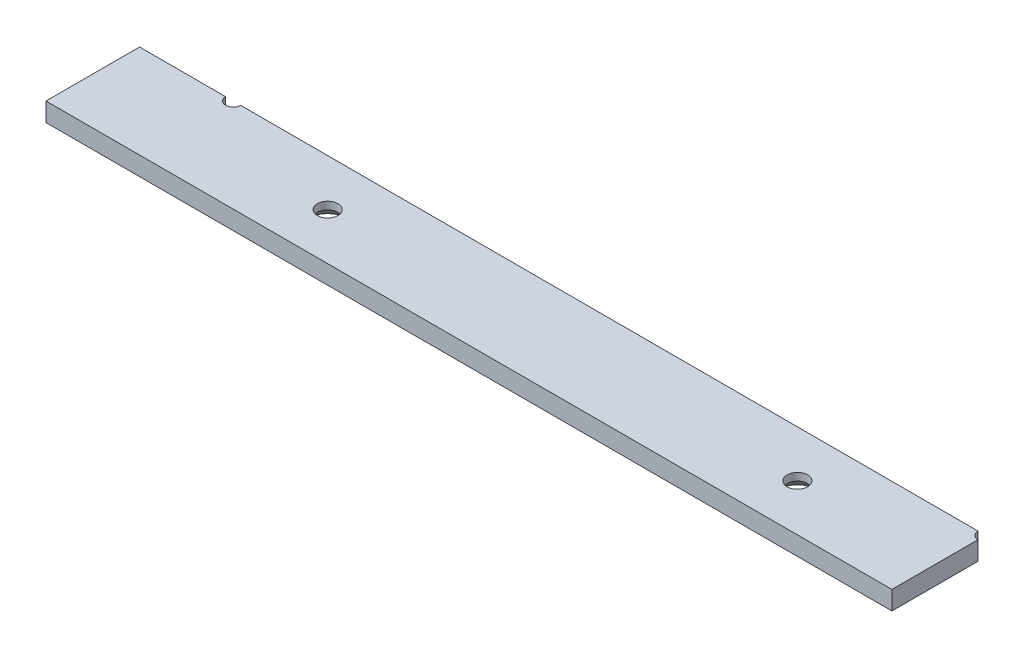
ISO-10303-21;
HEADER;
FILE_DESCRIPTION(('STEP AP214'),'2;1');
FILE_NAME('part.step','',(''),(''),'','','');
FILE_SCHEMA(('AUTOMOTIVE_DESIGN { 1 0 10303 214 1 1 1 1 }'));
ENDSEC;
DATA;
#1=APPLICATION_CONTEXT('core data for automotive mechanical design processes');
#2=APPLICATION_PROTOCOL_DEFINITION('international standard','automotive_design',2000,#1);
#3=PRODUCT_CONTEXT('',#1,'mechanical');
#4=PRODUCT('Part','Part','',(#3));
#5=PRODUCT_RELATED_PRODUCT_CATEGORY('part','',(#4));
#6=PRODUCT_DEFINITION_FORMATION('','',#4);
#7=PRODUCT_DEFINITION_CONTEXT('part definition',#1,'design');
#8=PRODUCT_DEFINITION('design','',#6,#7);
#9=PRODUCT_DEFINITION_SHAPE('','',#8);
#10=(LENGTH_UNIT() NAMED_UNIT(*) SI_UNIT(.MILLI.,.METRE.));
#11=(NAMED_UNIT(*) PLANE_ANGLE_UNIT() SI_UNIT($,.RADIAN.));
#12=(NAMED_UNIT(*) SI_UNIT($,.STERADIAN.) SOLID_ANGLE_UNIT());
#13=UNCERTAINTY_MEASURE_WITH_UNIT(LENGTH_MEASURE(1.E-05),#10,'distance_accuracy_value','');
#14=(GEOMETRIC_REPRESENTATION_CONTEXT(3) GLOBAL_UNCERTAINTY_ASSIGNED_CONTEXT((#13)) GLOBAL_UNIT_ASSIGNED_CONTEXT((#10,
#11,#12)) REPRESENTATION_CONTEXT('',''));
#15=CARTESIAN_POINT('',(0.,0.,0.));
#16=DIRECTION('',(0.,0.,1.));
#17=DIRECTION('',(1.,0.,0.));
#18=AXIS2_PLACEMENT_3D('',#15,#16,#17);
#19=CARTESIAN_POINT('',(0.,5.,-25.));
#20=DIRECTION('',(0.,0.,1.));
#21=DIRECTION('',(1.,0.,0.));
#22=AXIS2_PLACEMENT_3D('',#19,#20,#21);
#23=PLANE('',#22);
#24=DIRECTION('',(-1.,0.,0.));
#25=VECTOR('',#24,1.);
#26=CARTESIAN_POINT('',(0.,5.,-25.));
#27=LINE('',#26,#25);
#28=CARTESIAN_POINT('',(224.,5.,-25.));
#29=VERTEX_POINT('',#28);
#30=CARTESIAN_POINT('',(27.,5.,-25.));
#31=VERTEX_POINT('',#30);
#32=EDGE_CURVE('E99',#29,#31,#27,.T.);
#33=ORIENTED_EDGE('',*,*,#32,.F.);
#34=DIRECTION('',(0.,1.,0.));
#35=VECTOR('',#34,1.);
#36=CARTESIAN_POINT('',(224.,0.,-25.));
#37=LINE('',#36,#35);
#38=CARTESIAN_POINT('',(224.,0.,-25.));
#39=VERTEX_POINT('',#38);
#40=EDGE_CURVE('E93',#29,#39,#37,.F.);
#41=ORIENTED_EDGE('',*,*,#40,.T.);
#42=DIRECTION('',(-1.,0.,0.));
#43=VECTOR('',#42,1.);
#44=CARTESIAN_POINT('',(0.,0.,-25.));
#45=LINE('',#44,#43);
#46=CARTESIAN_POINT('',(27.,0.,-25.));
#47=VERTEX_POINT('',#46);
#48=EDGE_CURVE('E57',#39,#47,#45,.T.);
#49=ORIENTED_EDGE('',*,*,#48,.T.);
#50=DIRECTION('',(0.,1.,0.));
#51=VECTOR('',#50,1.);
#52=CARTESIAN_POINT('',(27.,0.,-25.));
#53=LINE('',#52,#51);
#54=EDGE_CURVE('E129',#47,#31,#53,.T.);
#55=ORIENTED_EDGE('',*,*,#54,.T.);
#56=EDGE_LOOP('',(#33,#41,#49,#55));
#57=FACE_BOUND('',#56,.T.);
#58=ADVANCED_FACE('F35',(#57),#23,.F.);
#59=CARTESIAN_POINT('',(0.,5.,0.));
#60=DIRECTION('',(1.,0.,0.));
#61=DIRECTION('',(0.,0.,-1.));
#62=AXIS2_PLACEMENT_3D('',#59,#60,#61);
#63=PLANE('',#62);
#64=DIRECTION('',(0.,0.,1.));
#65=VECTOR('',#64,1.);
#66=CARTESIAN_POINT('',(0.,0.,0.));
#67=LINE('',#66,#65);
#68=CARTESIAN_POINT('',(0.,0.,-25.));
#69=VERTEX_POINT('',#68);
#70=CARTESIAN_POINT('',(0.,0.,0.));
#71=VERTEX_POINT('',#70);
#72=EDGE_CURVE('E138',#69,#71,#67,.T.);
#73=ORIENTED_EDGE('',*,*,#72,.T.);
#74=DIRECTION('',(0.,-1.,0.));
#75=VECTOR('',#74,1.);
#76=CARTESIAN_POINT('',(0.,5.,0.));
#77=LINE('',#76,#75);
#78=CARTESIAN_POINT('',(0.,5.,0.));
#79=VERTEX_POINT('',#78);
#80=EDGE_CURVE('E121',#79,#71,#77,.T.);
#81=ORIENTED_EDGE('',*,*,#80,.F.);
#82=DIRECTION('',(0.,0.,1.));
#83=VECTOR('',#82,1.);
#84=CARTESIAN_POINT('',(0.,5.,0.));
#85=LINE('',#84,#83);
#86=CARTESIAN_POINT('',(0.,5.,-25.));
#87=VERTEX_POINT('',#86);
#88=EDGE_CURVE('E105',#87,#79,#85,.T.);
#89=ORIENTED_EDGE('',*,*,#88,.F.);
#90=DIRECTION('',(0.,-1.,0.));
#91=VECTOR('',#90,1.);
#92=CARTESIAN_POINT('',(0.,5.,-25.));
#93=LINE('',#92,#91);
#94=EDGE_CURVE('E115',#87,#69,#93,.T.);
#95=ORIENTED_EDGE('',*,*,#94,.T.);
#96=EDGE_LOOP('',(#73,#81,#89,#95));
#97=FACE_BOUND('',#96,.T.);
#98=ADVANCED_FACE('F37',(#97),#63,.F.);
#99=CARTESIAN_POINT('',(0.,5.,0.));
#100=DIRECTION('',(0.,0.,-1.));
#101=DIRECTION('',(-1.,0.,0.));
#102=AXIS2_PLACEMENT_3D('',#99,#100,#101);
#103=PLANE('',#102);
#104=DIRECTION('',(1.,0.,0.));
#105=VECTOR('',#104,1.);
#106=CARTESIAN_POINT('',(0.,0.,0.));
#107=LINE('',#106,#105);
#108=CARTESIAN_POINT('',(226.,0.,0.));
#109=VERTEX_POINT('',#108);
#110=EDGE_CURVE('E139',#71,#109,#107,.T.);
#111=ORIENTED_EDGE('',*,*,#110,.T.);
#112=DIRECTION('',(0.,-1.,0.));
#113=VECTOR('',#112,1.);
#114=CARTESIAN_POINT('',(226.,5.,0.));
#115=LINE('',#114,#113);
#116=CARTESIAN_POINT('',(226.,5.,0.));
#117=VERTEX_POINT('',#116);
#118=EDGE_CURVE('E118',#117,#109,#115,.T.);
#119=ORIENTED_EDGE('',*,*,#118,.F.);
#120=DIRECTION('',(1.,0.,0.));
#121=VECTOR('',#120,1.);
#122=CARTESIAN_POINT('',(0.,5.,0.));
#123=LINE('',#122,#121);
#124=EDGE_CURVE('E109',#79,#117,#123,.T.);
#125=ORIENTED_EDGE('',*,*,#124,.F.);
#126=ORIENTED_EDGE('',*,*,#80,.T.);
#127=EDGE_LOOP('',(#111,#119,#125,#126));
#128=FACE_BOUND('',#127,.T.);
#129=ADVANCED_FACE('F201',(#128),#103,.F.);
#130=CARTESIAN_POINT('',(226.,5.,0.));
#131=DIRECTION('',(-1.,0.,0.));
#132=DIRECTION('',(0.,0.,1.));
#133=AXIS2_PLACEMENT_3D('',#130,#131,#132);
#134=PLANE('',#133);
#135=DIRECTION('',(0.,0.,-1.));
#136=VECTOR('',#135,1.);
#137=CARTESIAN_POINT('',(226.,0.,0.));
#138=LINE('',#137,#136);
#139=CARTESIAN_POINT('',(226.,0.,-23.));
#140=VERTEX_POINT('',#139);
#141=EDGE_CURVE('E111',#109,#140,#138,.T.);
#142=ORIENTED_EDGE('',*,*,#141,.T.);
#143=DIRECTION('',(0.,1.,0.));
#144=VECTOR('',#143,1.);
#145=CARTESIAN_POINT('',(226.,0.,-23.));
#146=LINE('',#145,#144);
#147=CARTESIAN_POINT('',(226.,5.,-23.));
#148=VERTEX_POINT('',#147);
#149=EDGE_CURVE('E49',#140,#148,#146,.T.);
#150=ORIENTED_EDGE('',*,*,#149,.T.);
#151=DIRECTION('',(0.,0.,-1.));
#152=VECTOR('',#151,1.);
#153=CARTESIAN_POINT('',(226.,5.,0.));
#154=LINE('',#153,#152);
#155=EDGE_CURVE('E146',#117,#148,#154,.T.);
#156=ORIENTED_EDGE('',*,*,#155,.F.);
#157=ORIENTED_EDGE('',*,*,#118,.T.);
#158=EDGE_LOOP('',(#142,#150,#156,#157));
#159=FACE_BOUND('',#158,.T.);
#160=ADVANCED_FACE('F204',(#159),#134,.F.);
#161=CARTESIAN_POINT('',(23.,5.,-25.));
#162=VERTEX_POINT('',#161);
#163=EDGE_CURVE('E134',#162,#87,#27,.T.);
#164=ORIENTED_EDGE('',*,*,#163,.F.);
#165=DIRECTION('',(0.,1.,0.));
#166=VECTOR('',#165,1.);
#167=CARTESIAN_POINT('',(23.,0.,-25.));
#168=LINE('',#167,#166);
#169=CARTESIAN_POINT('',(23.,0.,-25.));
#170=VERTEX_POINT('',#169);
#171=EDGE_CURVE('E127',#162,#170,#168,.F.);
#172=ORIENTED_EDGE('',*,*,#171,.T.);
#173=EDGE_CURVE('E106',#170,#69,#45,.T.);
#174=ORIENTED_EDGE('',*,*,#173,.T.);
#175=ORIENTED_EDGE('',*,*,#94,.F.);
#176=EDGE_LOOP('',(#164,#172,#174,#175));
#177=FACE_BOUND('',#176,.T.);
#178=ADVANCED_FACE('F132',(#177),#23,.F.);
#179=CARTESIAN_POINT('',(0.,5.,0.));
#180=DIRECTION('',(0.,-1.,0.));
#181=DIRECTION('',(0.,0.,-1.));
#182=AXIS2_PLACEMENT_3D('',#179,#180,#181);
#183=PLANE('',#182);
#184=CARTESIAN_POINT('',(62.75,5.,-12.5));
#185=DIRECTION('',(0.,-1.,0.));
#186=DIRECTION('',(0.,0.,-1.));
#187=AXIS2_PLACEMENT_3D('',#184,#185,#186);
#188=CIRCLE('',#187,2.74999999999999);
#189=CARTESIAN_POINT('',(62.75,5.,-15.25));
#190=VERTEX_POINT('',#189);
#191=EDGE_CURVE('E163',#190,#190,#188,.T.);
#192=ORIENTED_EDGE('',*,*,#191,.T.);
#193=EDGE_LOOP('',(#192));
#194=FACE_BOUND('',#193,.T.);
#195=CARTESIAN_POINT('',(188.25,5.,-12.5));
#196=DIRECTION('',(0.,-1.,0.));
#197=DIRECTION('',(0.,0.,-1.));
#198=AXIS2_PLACEMENT_3D('',#195,#196,#197);
#199=CIRCLE('',#198,2.75);
#200=CARTESIAN_POINT('',(188.25,5.,-15.25));
#201=VERTEX_POINT('',#200);
#202=EDGE_CURVE('E154',#201,#201,#199,.T.);
#203=ORIENTED_EDGE('',*,*,#202,.T.);
#204=EDGE_LOOP('',(#203));
#205=FACE_BOUND('',#204,.T.);
#206=ORIENTED_EDGE('',*,*,#155,.T.);
#207=CARTESIAN_POINT('',(226.,5.,-25.));
#208=DIRECTION('',(0.,1.,0.));
#209=DIRECTION('',(0.,0.,1.));
#210=AXIS2_PLACEMENT_3D('',#207,#208,#209);
#211=CIRCLE('',#210,2.);
#212=EDGE_CURVE('E152',#29,#148,#211,.T.);
#213=ORIENTED_EDGE('',*,*,#212,.F.);
#214=ORIENTED_EDGE('',*,*,#32,.T.);
#215=CARTESIAN_POINT('',(25.,5.,-25.));
#216=DIRECTION('',(0.,1.,0.));
#217=DIRECTION('',(0.,0.,1.));
#218=AXIS2_PLACEMENT_3D('',#215,#216,#217);
#219=CIRCLE('',#218,2.);
#220=EDGE_CURVE('E100',#162,#31,#219,.T.);
#221=ORIENTED_EDGE('',*,*,#220,.F.);
#222=ORIENTED_EDGE('',*,*,#163,.T.);
#223=ORIENTED_EDGE('',*,*,#88,.T.);
#224=ORIENTED_EDGE('',*,*,#124,.T.);
#225=EDGE_LOOP('',(#206,#213,#214,#221,#222,#223,#224));
#226=FACE_BOUND('',#225,.T.);
#227=ADVANCED_FACE('F177',(#194,#205,#226),#183,.F.);
#228=CARTESIAN_POINT('',(0.,0.,0.));
#229=DIRECTION('',(0.,-1.,0.));
#230=DIRECTION('',(0.,0.,-1.));
#231=AXIS2_PLACEMENT_3D('',#228,#229,#230);
#232=PLANE('',#231);
#233=CARTESIAN_POINT('',(62.75,0.,-12.5));
#234=DIRECTION('',(0.,-1.,0.));
#235=DIRECTION('',(0.,0.,-1.));
#236=AXIS2_PLACEMENT_3D('',#233,#234,#235);
#237=CIRCLE('',#236,5.735);
#238=CARTESIAN_POINT('',(62.75,0.,-18.235));
#239=VERTEX_POINT('',#238);
#240=EDGE_CURVE('E169',#239,#239,#237,.T.);
#241=ORIENTED_EDGE('',*,*,#240,.F.);
#242=EDGE_LOOP('',(#241));
#243=FACE_BOUND('',#242,.T.);
#244=CARTESIAN_POINT('',(188.25,0.,-12.5));
#245=DIRECTION('',(0.,-1.,0.));
#246=DIRECTION('',(0.,0.,-1.));
#247=AXIS2_PLACEMENT_3D('',#244,#245,#246);
#248=CIRCLE('',#247,5.73499999999999);
#249=CARTESIAN_POINT('',(188.25,0.,-18.235));
#250=VERTEX_POINT('',#249);
#251=EDGE_CURVE('E160',#250,#250,#248,.T.);
#252=ORIENTED_EDGE('',*,*,#251,.F.);
#253=EDGE_LOOP('',(#252));
#254=FACE_BOUND('',#253,.T.);
#255=CARTESIAN_POINT('',(226.,0.,-25.));
#256=DIRECTION('',(0.,-1.,0.));
#257=DIRECTION('',(0.,0.,-1.));
#258=AXIS2_PLACEMENT_3D('',#255,#256,#257);
#259=CIRCLE('',#258,2.);
#260=EDGE_CURVE('E11',#140,#39,#259,.T.);
#261=ORIENTED_EDGE('',*,*,#260,.F.);
#262=ORIENTED_EDGE('',*,*,#141,.F.);
#263=ORIENTED_EDGE('',*,*,#110,.F.);
#264=ORIENTED_EDGE('',*,*,#72,.F.);
#265=ORIENTED_EDGE('',*,*,#173,.F.);
#266=CARTESIAN_POINT('',(25.,0.,-25.));
#267=DIRECTION('',(0.,-1.,0.));
#268=DIRECTION('',(0.,0.,-1.));
#269=AXIS2_PLACEMENT_3D('',#266,#267,#268);
#270=CIRCLE('',#269,2.);
#271=EDGE_CURVE('E43',#47,#170,#270,.T.);
#272=ORIENTED_EDGE('',*,*,#271,.F.);
#273=ORIENTED_EDGE('',*,*,#48,.F.);
#274=EDGE_LOOP('',(#261,#262,#263,#264,#265,#272,#273));
#275=FACE_BOUND('',#274,.T.);
#276=ADVANCED_FACE('F103',(#243,#254,#275),#232,.T.);
#277=CARTESIAN_POINT('',(25.,0.,-25.));
#278=DIRECTION('',(0.,1.,0.));
#279=DIRECTION('',(0.,0.,1.));
#280=AXIS2_PLACEMENT_3D('',#277,#278,#279);
#281=CYLINDRICAL_SURFACE('',#280,2.);
#282=ORIENTED_EDGE('',*,*,#271,.T.);
#283=ORIENTED_EDGE('',*,*,#171,.F.);
#284=ORIENTED_EDGE('',*,*,#220,.T.);
#285=ORIENTED_EDGE('',*,*,#54,.F.);
#286=EDGE_LOOP('',(#282,#283,#284,#285));
#287=FACE_BOUND('',#286,.T.);
#288=ADVANCED_FACE('F125',(#287),#281,.F.);
#289=CARTESIAN_POINT('',(226.,0.,-25.));
#290=DIRECTION('',(0.,1.,0.));
#291=DIRECTION('',(0.,0.,1.));
#292=AXIS2_PLACEMENT_3D('',#289,#290,#291);
#293=CYLINDRICAL_SURFACE('',#292,2.);
#294=ORIENTED_EDGE('',*,*,#212,.T.);
#295=ORIENTED_EDGE('',*,*,#149,.F.);
#296=ORIENTED_EDGE('',*,*,#260,.T.);
#297=ORIENTED_EDGE('',*,*,#40,.F.);
#298=EDGE_LOOP('',(#294,#295,#296,#297));
#299=FACE_BOUND('',#298,.T.);
#300=ADVANCED_FACE('F92',(#299),#293,.F.);
#301=CARTESIAN_POINT('',(188.25,0.,-12.5));
#302=DIRECTION('',(0.,-1.,0.));
#303=DIRECTION('',(0.,0.,-1.));
#304=AXIS2_PLACEMENT_3D('',#301,#302,#303);
#305=CYLINDRICAL_SURFACE('',#304,2.75);
#306=ORIENTED_EDGE('',*,*,#202,.F.);
#307=EDGE_LOOP('',(#306));
#308=FACE_BOUND('',#307,.T.);
#309=CARTESIAN_POINT('',(188.25,2.985,-12.5));
#310=DIRECTION('',(0.,-1.,0.));
#311=DIRECTION('',(0.,0.,-1.));
#312=AXIS2_PLACEMENT_3D('',#309,#310,#311);
#313=CIRCLE('',#312,2.75);
#314=CARTESIAN_POINT('',(188.25,2.985,-15.25));
#315=VERTEX_POINT('',#314);
#316=EDGE_CURVE('E157',#315,#315,#313,.T.);
#317=ORIENTED_EDGE('',*,*,#316,.T.);
#318=EDGE_LOOP('',(#317));
#319=FACE_BOUND('',#318,.T.);
#320=ADVANCED_FACE('F184',(#308,#319),#305,.F.);
#321=CARTESIAN_POINT('',(188.25,0.,-12.5));
#322=DIRECTION('',(0.,-1.,0.));
#323=DIRECTION('',(0.,0.,-1.));
#324=AXIS2_PLACEMENT_3D('',#321,#322,#323);
#325=CONICAL_SURFACE('',#324,5.73499999999999,0.785398163397446);
#326=ORIENTED_EDGE('',*,*,#316,.F.);
#327=EDGE_LOOP('',(#326));
#328=FACE_BOUND('',#327,.T.);
#329=ORIENTED_EDGE('',*,*,#251,.T.);
#330=EDGE_LOOP('',(#329));
#331=FACE_BOUND('',#330,.T.);
#332=ADVANCED_FACE('F181',(#328,#331),#325,.F.);
#333=CARTESIAN_POINT('',(62.75,0.,-12.5));
#334=DIRECTION('',(0.,-1.,0.));
#335=DIRECTION('',(0.,0.,-1.));
#336=AXIS2_PLACEMENT_3D('',#333,#334,#335);
#337=CYLINDRICAL_SURFACE('',#336,2.74999999999999);
#338=ORIENTED_EDGE('',*,*,#191,.F.);
#339=EDGE_LOOP('',(#338));
#340=FACE_BOUND('',#339,.T.);
#341=CARTESIAN_POINT('',(62.75,2.985,-12.5));
#342=DIRECTION('',(0.,-1.,0.));
#343=DIRECTION('',(0.,0.,-1.));
#344=AXIS2_PLACEMENT_3D('',#341,#342,#343);
#345=CIRCLE('',#344,2.74999999999999);
#346=CARTESIAN_POINT('',(62.75,2.985,-15.25));
#347=VERTEX_POINT('',#346);
#348=EDGE_CURVE('E166',#347,#347,#345,.T.);
#349=ORIENTED_EDGE('',*,*,#348,.T.);
#350=EDGE_LOOP('',(#349));
#351=FACE_BOUND('',#350,.T.);
#352=ADVANCED_FACE('F183',(#340,#351),#337,.F.);
#353=CARTESIAN_POINT('',(62.75,0.,-12.5));
#354=DIRECTION('',(0.,-1.,0.));
#355=DIRECTION('',(0.,0.,-1.));
#356=AXIS2_PLACEMENT_3D('',#353,#354,#355);
#357=CONICAL_SURFACE('',#356,5.735,0.78539816339745);
#358=ORIENTED_EDGE('',*,*,#348,.F.);
#359=EDGE_LOOP('',(#358));
#360=FACE_BOUND('',#359,.T.);
#361=ORIENTED_EDGE('',*,*,#240,.T.);
#362=EDGE_LOOP('',(#361));
#363=FACE_BOUND('',#362,.T.);
#364=ADVANCED_FACE('F173',(#360,#363),#357,.F.);
#365=CLOSED_SHELL('',(#58,#98,#129,#160,#178,#227,#276,#288,#300,#320,#332,#352,#364));
#366=MANIFOLD_SOLID_BREP('B2',#365);
#367=ADVANCED_BREP_SHAPE_REPRESENTATION('',(#18,#366),#14);
#368=SHAPE_DEFINITION_REPRESENTATION(#9,#367);
ENDSEC;
END-ISO-10303-21;
